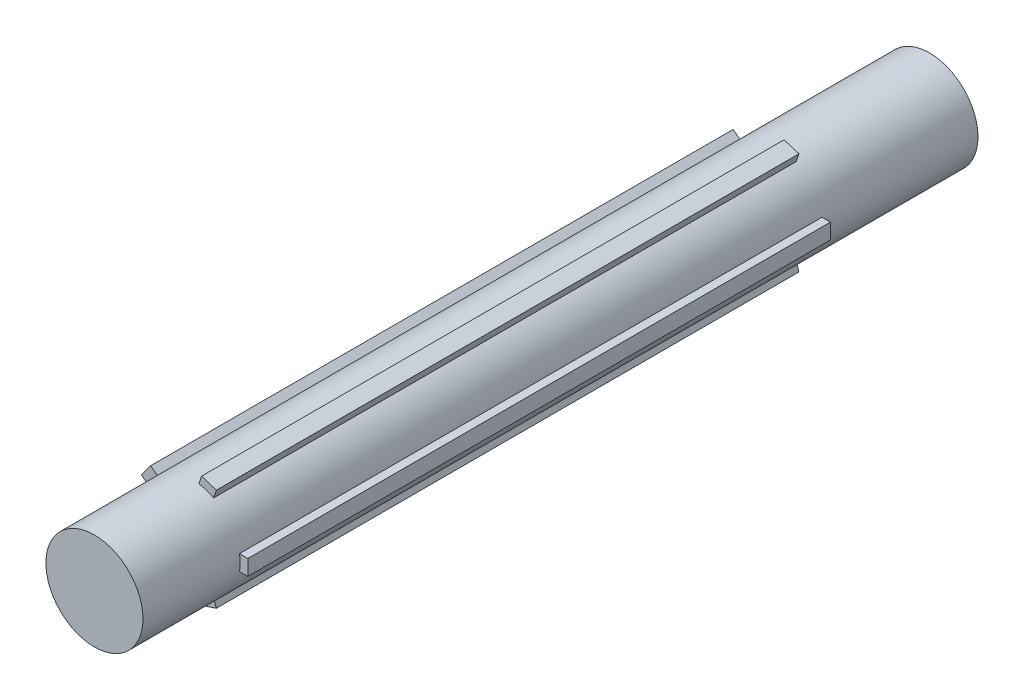
ISO-10303-21;
HEADER;
FILE_DESCRIPTION(('STEP AP214'),'2;1');
FILE_NAME('part.step','',(''),(''),'','','');
FILE_SCHEMA(('AUTOMOTIVE_DESIGN { 1 0 10303 214 1 1 1 1 }'));
ENDSEC;
DATA;
#1=APPLICATION_CONTEXT('core data for automotive mechanical design processes');
#2=APPLICATION_PROTOCOL_DEFINITION('international standard','automotive_design',2000,#1);
#3=PRODUCT_CONTEXT('',#1,'mechanical');
#4=PRODUCT('Part','Part','',(#3));
#5=PRODUCT_RELATED_PRODUCT_CATEGORY('part','',(#4));
#6=PRODUCT_DEFINITION_FORMATION('','',#4);
#7=PRODUCT_DEFINITION_CONTEXT('part definition',#1,'design');
#8=PRODUCT_DEFINITION('design','',#6,#7);
#9=PRODUCT_DEFINITION_SHAPE('','',#8);
#10=(LENGTH_UNIT() NAMED_UNIT(*) SI_UNIT(.MILLI.,.METRE.));
#11=(NAMED_UNIT(*) PLANE_ANGLE_UNIT() SI_UNIT($,.RADIAN.));
#12=(NAMED_UNIT(*) SI_UNIT($,.STERADIAN.) SOLID_ANGLE_UNIT());
#13=UNCERTAINTY_MEASURE_WITH_UNIT(LENGTH_MEASURE(1.E-05),#10,'distance_accuracy_value','');
#14=(GEOMETRIC_REPRESENTATION_CONTEXT(3) GLOBAL_UNCERTAINTY_ASSIGNED_CONTEXT((#13)) GLOBAL_UNIT_ASSIGNED_CONTEXT((#10,
#11,#12)) REPRESENTATION_CONTEXT('',''));
#15=CARTESIAN_POINT('',(0.,0.,0.));
#16=DIRECTION('',(0.,0.,1.));
#17=DIRECTION('',(1.,0.,0.));
#18=AXIS2_PLACEMENT_3D('',#15,#16,#17);
#19=CARTESIAN_POINT('',(0.,0.,215.));
#20=DIRECTION('',(0.,0.,-1.));
#21=DIRECTION('',(-1.,0.,0.));
#22=AXIS2_PLACEMENT_3D('',#19,#20,#21);
#23=CYLINDRICAL_SURFACE('',#22,12.5);
#24=DIRECTION('',(0.,0.,-1.));
#25=VECTOR('',#24,1.);
#26=CARTESIAN_POINT('',(5.71506219343786,11.1170168716764,215.));
#27=LINE('',#26,#25);
#28=CARTESIAN_POINT('',(5.71506219343786,11.1170168716764,40.));
#29=VERTEX_POINT('',#28);
#30=CARTESIAN_POINT('',(5.71506219343786,11.1170168716764,190.));
#31=VERTEX_POINT('',#30);
#32=EDGE_CURVE('E162',#29,#31,#27,.F.);
#33=ORIENTED_EDGE('',*,*,#32,.T.);
#34=CARTESIAN_POINT('',(0.,0.,190.));
#35=DIRECTION('',(0.,0.,1.));
#36=DIRECTION('',(1.,0.,0.));
#37=AXIS2_PLACEMENT_3D('',#34,#35,#36);
#38=CIRCLE('',#37,12.5);
#39=CARTESIAN_POINT('',(1.91083612825726,12.3530848491762,190.));
#40=VERTEX_POINT('',#39);
#41=EDGE_CURVE('E12',#31,#40,#38,.T.);
#42=ORIENTED_EDGE('',*,*,#41,.T.);
#43=DIRECTION('',(0.,0.,-1.));
#44=VECTOR('',#43,1.);
#45=CARTESIAN_POINT('',(1.91083612825726,12.3530848491762,215.));
#46=LINE('',#45,#44);
#47=CARTESIAN_POINT('',(1.91083612825726,12.3530848491762,40.));
#48=VERTEX_POINT('',#47);
#49=EDGE_CURVE('E454',#48,#40,#46,.F.);
#50=ORIENTED_EDGE('',*,*,#49,.F.);
#51=CARTESIAN_POINT('',(0.,0.,40.));
#52=DIRECTION('',(0.,0.,1.));
#53=DIRECTION('',(1.,0.,0.));
#54=AXIS2_PLACEMENT_3D('',#51,#52,#53);
#55=CIRCLE('',#54,12.5);
#56=EDGE_CURVE('E451',#29,#48,#55,.T.);
#57=ORIENTED_EDGE('',*,*,#56,.F.);
#58=EDGE_LOOP('',(#33,#42,#50,#57));
#59=FACE_BOUND('',#58,.T.);
#60=DIRECTION('',(0.,0.,-1.));
#61=VECTOR('',#60,1.);
#62=CARTESIAN_POINT('',(-8.80685999588894,8.87069428020215,215.));
#63=LINE('',#62,#61);
#64=CARTESIAN_POINT('',(-8.80685999588894,8.87069428020215,40.));
#65=VERTEX_POINT('',#64);
#66=CARTESIAN_POINT('',(-8.80685999588894,8.87069428020215,190.));
#67=VERTEX_POINT('',#66);
#68=EDGE_CURVE('E447',#65,#67,#63,.F.);
#69=ORIENTED_EDGE('',*,*,#68,.T.);
#70=CARTESIAN_POINT('',(0.,0.,190.));
#71=DIRECTION('',(0.,0.,1.));
#72=DIRECTION('',(1.,0.,0.));
#73=AXIS2_PLACEMENT_3D('',#70,#71,#72);
#74=CIRCLE('',#73,12.5);
#75=CARTESIAN_POINT('',(-11.1580010050589,5.63462630270238,190.));
#76=VERTEX_POINT('',#75);
#77=EDGE_CURVE('E449',#67,#76,#74,.T.);
#78=ORIENTED_EDGE('',*,*,#77,.T.);
#79=DIRECTION('',(0.,0.,-1.));
#80=VECTOR('',#79,1.);
#81=CARTESIAN_POINT('',(-11.1580010050589,5.63462630270238,215.));
#82=LINE('',#81,#80);
#83=CARTESIAN_POINT('',(-11.1580010050589,5.63462630270238,40.));
#84=VERTEX_POINT('',#83);
#85=EDGE_CURVE('E444',#84,#76,#82,.F.);
#86=ORIENTED_EDGE('',*,*,#85,.F.);
#87=CARTESIAN_POINT('',(0.,0.,40.));
#88=DIRECTION('',(0.,0.,1.));
#89=DIRECTION('',(1.,0.,0.));
#90=AXIS2_PLACEMENT_3D('',#87,#88,#89);
#91=CIRCLE('',#90,12.5);
#92=EDGE_CURVE('E441',#65,#84,#91,.T.);
#93=ORIENTED_EDGE('',*,*,#92,.F.);
#94=EDGE_LOOP('',(#69,#78,#86,#93));
#95=FACE_BOUND('',#94,.T.);
#96=DIRECTION('',(0.,0.,-1.));
#97=VECTOR('',#96,1.);
#98=CARTESIAN_POINT('',(-11.1580010050589,-5.63462630270222,215.));
#99=LINE('',#98,#97);
#100=CARTESIAN_POINT('',(-11.1580010050589,-5.63462630270222,40.));
#101=VERTEX_POINT('',#100);
#102=CARTESIAN_POINT('',(-11.1580010050589,-5.63462630270222,190.));
#103=VERTEX_POINT('',#102);
#104=EDGE_CURVE('E437',#101,#103,#99,.F.);
#105=ORIENTED_EDGE('',*,*,#104,.T.);
#106=CARTESIAN_POINT('',(0.,0.,190.));
#107=DIRECTION('',(0.,0.,1.));
#108=DIRECTION('',(1.,0.,0.));
#109=AXIS2_PLACEMENT_3D('',#106,#107,#108);
#110=CIRCLE('',#109,12.5);
#111=CARTESIAN_POINT('',(-8.80685999588907,-8.87069428020202,190.));
#112=VERTEX_POINT('',#111);
#113=EDGE_CURVE('E439',#103,#112,#110,.T.);
#114=ORIENTED_EDGE('',*,*,#113,.T.);
#115=DIRECTION('',(0.,0.,-1.));
#116=VECTOR('',#115,1.);
#117=CARTESIAN_POINT('',(-8.80685999588907,-8.87069428020202,215.));
#118=LINE('',#117,#116);
#119=CARTESIAN_POINT('',(-8.80685999588907,-8.87069428020202,40.));
#120=VERTEX_POINT('',#119);
#121=EDGE_CURVE('E434',#120,#112,#118,.F.);
#122=ORIENTED_EDGE('',*,*,#121,.F.);
#123=CARTESIAN_POINT('',(0.,0.,40.));
#124=DIRECTION('',(0.,0.,1.));
#125=DIRECTION('',(1.,0.,0.));
#126=AXIS2_PLACEMENT_3D('',#123,#124,#125);
#127=CIRCLE('',#126,12.5);
#128=EDGE_CURVE('E431',#101,#120,#127,.T.);
#129=ORIENTED_EDGE('',*,*,#128,.F.);
#130=EDGE_LOOP('',(#105,#114,#122,#129));
#131=FACE_BOUND('',#130,.T.);
#132=DIRECTION('',(0.,0.,-1.));
#133=VECTOR('',#132,1.);
#134=CARTESIAN_POINT('',(1.91083612825709,-12.3530848491762,215.));
#135=LINE('',#134,#133);
#136=CARTESIAN_POINT('',(1.91083612825709,-12.3530848491762,40.));
#137=VERTEX_POINT('',#136);
#138=CARTESIAN_POINT('',(1.91083612825709,-12.3530848491762,190.));
#139=VERTEX_POINT('',#138);
#140=EDGE_CURVE('E427',#137,#139,#135,.F.);
#141=ORIENTED_EDGE('',*,*,#140,.T.);
#142=CARTESIAN_POINT('',(0.,0.,190.));
#143=DIRECTION('',(0.,0.,1.));
#144=DIRECTION('',(1.,0.,0.));
#145=AXIS2_PLACEMENT_3D('',#142,#143,#144);
#146=CIRCLE('',#145,12.5);
#147=CARTESIAN_POINT('',(5.71506219343771,-11.1170168716765,190.));
#148=VERTEX_POINT('',#147);
#149=EDGE_CURVE('E429',#139,#148,#146,.T.);
#150=ORIENTED_EDGE('',*,*,#149,.T.);
#151=DIRECTION('',(0.,0.,-1.));
#152=VECTOR('',#151,1.);
#153=CARTESIAN_POINT('',(5.71506219343771,-11.1170168716765,215.));
#154=LINE('',#153,#152);
#155=CARTESIAN_POINT('',(5.71506219343771,-11.1170168716765,40.));
#156=VERTEX_POINT('',#155);
#157=EDGE_CURVE('E424',#156,#148,#154,.F.);
#158=ORIENTED_EDGE('',*,*,#157,.F.);
#159=CARTESIAN_POINT('',(0.,0.,40.));
#160=DIRECTION('',(0.,0.,1.));
#161=DIRECTION('',(1.,0.,0.));
#162=AXIS2_PLACEMENT_3D('',#159,#160,#161);
#163=CIRCLE('',#162,12.5);
#164=EDGE_CURVE('E421',#137,#156,#163,.T.);
#165=ORIENTED_EDGE('',*,*,#164,.F.);
#166=EDGE_LOOP('',(#141,#150,#158,#165));
#167=FACE_BOUND('',#166,.T.);
#168=CARTESIAN_POINT('',(0.,0.,0.));
#169=DIRECTION('',(0.,0.,1.));
#170=DIRECTION('',(1.,0.,0.));
#171=AXIS2_PLACEMENT_3D('',#168,#169,#170);
#172=CIRCLE('',#171,12.5);
#173=CARTESIAN_POINT('',(12.5,0.,0.));
#174=VERTEX_POINT('',#173);
#175=EDGE_CURVE('E404',#174,#174,#172,.T.);
#176=ORIENTED_EDGE('',*,*,#175,.T.);
#177=EDGE_LOOP('',(#176));
#178=FACE_BOUND('',#177,.T.);
#179=CARTESIAN_POINT('',(0.,0.,215.));
#180=DIRECTION('',(0.,0.,1.));
#181=DIRECTION('',(1.,0.,0.));
#182=AXIS2_PLACEMENT_3D('',#179,#180,#181);
#183=CIRCLE('',#182,12.5);
#184=CARTESIAN_POINT('',(12.5,0.,215.));
#185=VERTEX_POINT('',#184);
#186=EDGE_CURVE('E405',#185,#185,#183,.T.);
#187=ORIENTED_EDGE('',*,*,#186,.F.);
#188=EDGE_LOOP('',(#187));
#189=FACE_BOUND('',#188,.T.);
#190=CARTESIAN_POINT('',(0.,0.,40.));
#191=DIRECTION('',(0.,0.,1.));
#192=DIRECTION('',(1.,0.,0.));
#193=AXIS2_PLACEMENT_3D('',#190,#191,#192);
#194=CIRCLE('',#193,12.5);
#195=CARTESIAN_POINT('',(12.3389626792531,-2.,40.));
#196=VERTEX_POINT('',#195);
#197=CARTESIAN_POINT('',(12.3389626792531,2.,40.));
#198=VERTEX_POINT('',#197);
#199=EDGE_CURVE('E419',#196,#198,#194,.T.);
#200=ORIENTED_EDGE('',*,*,#199,.F.);
#201=DIRECTION('',(0.,0.,-1.));
#202=VECTOR('',#201,1.);
#203=CARTESIAN_POINT('',(12.3389626792531,-2.,215.));
#204=LINE('',#203,#202);
#205=CARTESIAN_POINT('',(12.3389626792531,-2.,190.));
#206=VERTEX_POINT('',#205);
#207=EDGE_CURVE('E416',#196,#206,#204,.F.);
#208=ORIENTED_EDGE('',*,*,#207,.T.);
#209=CARTESIAN_POINT('',(0.,0.,190.));
#210=DIRECTION('',(0.,0.,1.));
#211=DIRECTION('',(1.,0.,0.));
#212=AXIS2_PLACEMENT_3D('',#209,#210,#211);
#213=CIRCLE('',#212,12.5);
#214=CARTESIAN_POINT('',(12.3389626792531,2.,190.));
#215=VERTEX_POINT('',#214);
#216=EDGE_CURVE('E408',#206,#215,#213,.T.);
#217=ORIENTED_EDGE('',*,*,#216,.T.);
#218=DIRECTION('',(0.,0.,-1.));
#219=VECTOR('',#218,1.);
#220=CARTESIAN_POINT('',(12.3389626792531,2.,215.));
#221=LINE('',#220,#219);
#222=EDGE_CURVE('E413',#198,#215,#221,.F.);
#223=ORIENTED_EDGE('',*,*,#222,.F.);
#224=EDGE_LOOP('',(#200,#208,#217,#223));
#225=FACE_BOUND('',#224,.T.);
#226=ADVANCED_FACE('F155',(#59,#95,#131,#167,#178,#189,#225),#23,.T.);
#227=CARTESIAN_POINT('',(0.,0.,215.));
#228=DIRECTION('',(0.,0.,1.));
#229=DIRECTION('',(1.,0.,0.));
#230=AXIS2_PLACEMENT_3D('',#227,#228,#229);
#231=PLANE('',#230);
#232=ORIENTED_EDGE('',*,*,#186,.T.);
#233=EDGE_LOOP('',(#232));
#234=FACE_BOUND('',#233,.T.);
#235=ADVANCED_FACE('F469',(#234),#231,.T.);
#236=CARTESIAN_POINT('',(0.,0.,0.));
#237=DIRECTION('',(0.,0.,1.));
#238=DIRECTION('',(1.,0.,0.));
#239=AXIS2_PLACEMENT_3D('',#236,#237,#238);
#240=PLANE('',#239);
#241=ORIENTED_EDGE('',*,*,#175,.F.);
#242=EDGE_LOOP('',(#241));
#243=FACE_BOUND('',#242,.T.);
#244=ADVANCED_FACE('F473',(#243),#240,.F.);
#245=CARTESIAN_POINT('',(0.,-2.,190.));
#246=DIRECTION('',(0.,-1.,0.));
#247=DIRECTION('',(0.,0.,-1.));
#248=AXIS2_PLACEMENT_3D('',#245,#246,#247);
#249=PLANE('',#248);
#250=ORIENTED_EDGE('',*,*,#207,.F.);
#251=DIRECTION('',(-1.,0.,0.));
#252=VECTOR('',#251,1.);
#253=CARTESIAN_POINT('',(0.,-2.,40.));
#254=LINE('',#253,#252);
#255=CARTESIAN_POINT('',(14.5,-2.,40.));
#256=VERTEX_POINT('',#255);
#257=EDGE_CURVE('E383',#256,#196,#254,.T.);
#258=ORIENTED_EDGE('',*,*,#257,.F.);
#259=DIRECTION('',(0.,0.,-1.));
#260=VECTOR('',#259,1.);
#261=CARTESIAN_POINT('',(14.5,-2.,190.));
#262=LINE('',#261,#260);
#263=CARTESIAN_POINT('',(14.5,-2.,190.));
#264=VERTEX_POINT('',#263);
#265=EDGE_CURVE('E402',#264,#256,#262,.T.);
#266=ORIENTED_EDGE('',*,*,#265,.F.);
#267=DIRECTION('',(-1.,0.,0.));
#268=VECTOR('',#267,1.);
#269=CARTESIAN_POINT('',(0.,-2.,190.));
#270=LINE('',#269,#268);
#271=EDGE_CURVE('E384',#264,#206,#270,.T.);
#272=ORIENTED_EDGE('',*,*,#271,.T.);
#273=EDGE_LOOP('',(#250,#258,#266,#272));
#274=FACE_BOUND('',#273,.T.);
#275=ADVANCED_FACE('F479',(#274),#249,.T.);
#276=CARTESIAN_POINT('',(0.,2.,190.));
#277=DIRECTION('',(0.,-1.,0.));
#278=DIRECTION('',(1.,0.,0.));
#279=AXIS2_PLACEMENT_3D('',#276,#277,#278);
#280=PLANE('',#279);
#281=DIRECTION('',(-1.,0.,0.));
#282=VECTOR('',#281,1.);
#283=CARTESIAN_POINT('',(0.,2.,40.));
#284=LINE('',#283,#282);
#285=CARTESIAN_POINT('',(14.5,2.,40.));
#286=VERTEX_POINT('',#285);
#287=EDGE_CURVE('E388',#286,#198,#284,.T.);
#288=ORIENTED_EDGE('',*,*,#287,.T.);
#289=ORIENTED_EDGE('',*,*,#222,.T.);
#290=DIRECTION('',(-1.,0.,0.));
#291=VECTOR('',#290,1.);
#292=CARTESIAN_POINT('',(0.,2.,190.));
#293=LINE('',#292,#291);
#294=CARTESIAN_POINT('',(14.5,2.,190.));
#295=VERTEX_POINT('',#294);
#296=EDGE_CURVE('E391',#295,#215,#293,.T.);
#297=ORIENTED_EDGE('',*,*,#296,.F.);
#298=DIRECTION('',(0.,0.,-1.));
#299=VECTOR('',#298,1.);
#300=CARTESIAN_POINT('',(14.5,2.,190.));
#301=LINE('',#300,#299);
#302=EDGE_CURVE('E393',#295,#286,#301,.T.);
#303=ORIENTED_EDGE('',*,*,#302,.T.);
#304=EDGE_LOOP('',(#288,#289,#297,#303));
#305=FACE_BOUND('',#304,.T.);
#306=ADVANCED_FACE('F484',(#305),#280,.F.);
#307=CARTESIAN_POINT('',(14.5,0.,190.));
#308=DIRECTION('',(1.,0.,0.));
#309=DIRECTION('',(0.,0.,-1.));
#310=AXIS2_PLACEMENT_3D('',#307,#308,#309);
#311=PLANE('',#310);
#312=DIRECTION('',(0.,-1.,0.));
#313=VECTOR('',#312,1.);
#314=CARTESIAN_POINT('',(14.5,0.,40.));
#315=LINE('',#314,#313);
#316=EDGE_CURVE('E396',#286,#256,#315,.T.);
#317=ORIENTED_EDGE('',*,*,#316,.F.);
#318=ORIENTED_EDGE('',*,*,#302,.F.);
#319=DIRECTION('',(0.,-1.,0.));
#320=VECTOR('',#319,1.);
#321=CARTESIAN_POINT('',(14.5,0.,190.));
#322=LINE('',#321,#320);
#323=EDGE_CURVE('E387',#295,#264,#322,.T.);
#324=ORIENTED_EDGE('',*,*,#323,.T.);
#325=ORIENTED_EDGE('',*,*,#265,.T.);
#326=EDGE_LOOP('',(#317,#318,#324,#325));
#327=FACE_BOUND('',#326,.T.);
#328=ADVANCED_FACE('F486',(#327),#311,.T.);
#329=CARTESIAN_POINT('',(0.,0.,40.));
#330=DIRECTION('',(0.,0.,1.));
#331=DIRECTION('',(1.,0.,0.));
#332=AXIS2_PLACEMENT_3D('',#329,#330,#331);
#333=PLANE('',#332);
#334=ORIENTED_EDGE('',*,*,#257,.T.);
#335=ORIENTED_EDGE('',*,*,#199,.T.);
#336=ORIENTED_EDGE('',*,*,#287,.F.);
#337=ORIENTED_EDGE('',*,*,#316,.T.);
#338=EDGE_LOOP('',(#334,#335,#336,#337));
#339=FACE_BOUND('',#338,.T.);
#340=ADVANCED_FACE('F489',(#339),#333,.F.);
#341=CARTESIAN_POINT('',(0.,0.,190.));
#342=DIRECTION('',(0.,0.,1.));
#343=DIRECTION('',(1.,0.,0.));
#344=AXIS2_PLACEMENT_3D('',#341,#342,#343);
#345=PLANE('',#344);
#346=ORIENTED_EDGE('',*,*,#216,.F.);
#347=ORIENTED_EDGE('',*,*,#271,.F.);
#348=ORIENTED_EDGE('',*,*,#323,.F.);
#349=ORIENTED_EDGE('',*,*,#296,.T.);
#350=EDGE_LOOP('',(#346,#347,#348,#349));
#351=FACE_BOUND('',#350,.T.);
#352=ADVANCED_FACE('F491',(#351),#345,.T.);
#353=CARTESIAN_POINT('',(-1.90211303259031,-0.61803398874989,190.));
#354=DIRECTION('',(-0.951056516295154,-0.309016994374945,0.));
#355=DIRECTION('',(0.309016994374945,-0.951056516295155,0.));
#356=AXIS2_PLACEMENT_3D('',#353,#354,#355);
#357=PLANE('',#356);
#358=ORIENTED_EDGE('',*,*,#140,.F.);
#359=DIRECTION('',(-0.309016994374945,0.951056516295155,0.));
#360=VECTOR('',#359,1.);
#361=CARTESIAN_POINT('',(-1.90211303259031,-0.61803398874989,40.));
#362=LINE('',#361,#360);
#363=CARTESIAN_POINT('',(2.57863338584639,-14.4083534750296,40.));
#364=VERTEX_POINT('',#363);
#365=EDGE_CURVE('E361',#364,#137,#362,.T.);
#366=ORIENTED_EDGE('',*,*,#365,.F.);
#367=DIRECTION('',(0.,0.,-1.));
#368=VECTOR('',#367,1.);
#369=CARTESIAN_POINT('',(2.57863338584639,-14.4083534750296,190.));
#370=LINE('',#369,#368);
#371=CARTESIAN_POINT('',(2.57863338584639,-14.4083534750296,190.));
#372=VERTEX_POINT('',#371);
#373=EDGE_CURVE('E381',#372,#364,#370,.T.);
#374=ORIENTED_EDGE('',*,*,#373,.F.);
#375=DIRECTION('',(-0.309016994374945,0.951056516295155,0.));
#376=VECTOR('',#375,1.);
#377=CARTESIAN_POINT('',(-1.90211303259031,-0.61803398874989,190.));
#378=LINE('',#377,#376);
#379=EDGE_CURVE('E362',#372,#139,#378,.T.);
#380=ORIENTED_EDGE('',*,*,#379,.T.);
#381=EDGE_LOOP('',(#358,#366,#374,#380));
#382=FACE_BOUND('',#381,.T.);
#383=ADVANCED_FACE('F500',(#382),#357,.T.);
#384=CARTESIAN_POINT('',(1.90211303259031,0.618033988749889,190.));
#385=DIRECTION('',(-0.951056516295154,-0.309016994374945,0.));
#386=DIRECTION('',(0.309016994374945,-0.951056516295154,0.));
#387=AXIS2_PLACEMENT_3D('',#384,#385,#386);
#388=PLANE('',#387);
#389=DIRECTION('',(-0.309016994374945,0.951056516295155,0.));
#390=VECTOR('',#389,1.);
#391=CARTESIAN_POINT('',(1.90211303259031,0.618033988749889,40.));
#392=LINE('',#391,#390);
#393=CARTESIAN_POINT('',(6.38285945102701,-13.1722854975299,40.));
#394=VERTEX_POINT('',#393);
#395=EDGE_CURVE('E366',#394,#156,#392,.T.);
#396=ORIENTED_EDGE('',*,*,#395,.T.);
#397=ORIENTED_EDGE('',*,*,#157,.T.);
#398=DIRECTION('',(-0.309016994374945,0.951056516295155,0.));
#399=VECTOR('',#398,1.);
#400=CARTESIAN_POINT('',(1.90211303259031,0.618033988749889,190.));
#401=LINE('',#400,#399);
#402=CARTESIAN_POINT('',(6.38285945102701,-13.1722854975299,190.));
#403=VERTEX_POINT('',#402);
#404=EDGE_CURVE('E369',#403,#148,#401,.T.);
#405=ORIENTED_EDGE('',*,*,#404,.F.);
#406=DIRECTION('',(0.,0.,-1.));
#407=VECTOR('',#406,1.);
#408=CARTESIAN_POINT('',(6.38285945102701,-13.1722854975299,190.));
#409=LINE('',#408,#407);
#410=EDGE_CURVE('E372',#403,#394,#409,.T.);
#411=ORIENTED_EDGE('',*,*,#410,.T.);
#412=EDGE_LOOP('',(#396,#397,#405,#411));
#413=FACE_BOUND('',#412,.T.);
#414=ADVANCED_FACE('F504',(#413),#388,.F.);
#415=CARTESIAN_POINT('',(4.4807464184367,-13.7903194862797,190.));
#416=DIRECTION('',(0.309016994374945,-0.951056516295154,0.));
#417=DIRECTION('',(0.951056516295155,0.309016994374945,0.));
#418=AXIS2_PLACEMENT_3D('',#415,#416,#417);
#419=PLANE('',#418);
#420=DIRECTION('',(-0.951056516295155,-0.309016994374945,0.));
#421=VECTOR('',#420,1.);
#422=CARTESIAN_POINT('',(4.4807464184367,-13.7903194862797,40.));
#423=LINE('',#422,#421);
#424=EDGE_CURVE('E375',#394,#364,#423,.T.);
#425=ORIENTED_EDGE('',*,*,#424,.F.);
#426=ORIENTED_EDGE('',*,*,#410,.F.);
#427=DIRECTION('',(-0.951056516295155,-0.309016994374945,0.));
#428=VECTOR('',#427,1.);
#429=CARTESIAN_POINT('',(4.4807464184367,-13.7903194862797,190.));
#430=LINE('',#429,#428);
#431=EDGE_CURVE('E365',#403,#372,#430,.T.);
#432=ORIENTED_EDGE('',*,*,#431,.T.);
#433=ORIENTED_EDGE('',*,*,#373,.T.);
#434=EDGE_LOOP('',(#425,#426,#432,#433));
#435=FACE_BOUND('',#434,.T.);
#436=ADVANCED_FACE('F506',(#435),#419,.T.);
#437=CARTESIAN_POINT('',(0.,0.,190.));
#438=DIRECTION('',(0.,0.,1.));
#439=DIRECTION('',(0.309016994374945,-0.951056516295155,0.));
#440=AXIS2_PLACEMENT_3D('',#437,#438,#439);
#441=PLANE('',#440);
#442=ORIENTED_EDGE('',*,*,#149,.F.);
#443=ORIENTED_EDGE('',*,*,#379,.F.);
#444=ORIENTED_EDGE('',*,*,#431,.F.);
#445=ORIENTED_EDGE('',*,*,#404,.T.);
#446=EDGE_LOOP('',(#442,#443,#444,#445));
#447=FACE_BOUND('',#446,.T.);
#448=ADVANCED_FACE('F509',(#447),#441,.T.);
#449=CARTESIAN_POINT('',(0.,0.,40.));
#450=DIRECTION('',(0.,0.,1.));
#451=DIRECTION('',(0.309016994374945,-0.951056516295155,0.));
#452=AXIS2_PLACEMENT_3D('',#449,#450,#451);
#453=PLANE('',#452);
#454=ORIENTED_EDGE('',*,*,#365,.T.);
#455=ORIENTED_EDGE('',*,*,#164,.T.);
#456=ORIENTED_EDGE('',*,*,#395,.F.);
#457=ORIENTED_EDGE('',*,*,#424,.T.);
#458=EDGE_LOOP('',(#454,#455,#456,#457));
#459=FACE_BOUND('',#458,.T.);
#460=ADVANCED_FACE('F514',(#459),#453,.F.);
#461=CARTESIAN_POINT('',(-1.17557050458494,1.6180339887499,190.));
#462=DIRECTION('',(-0.587785252292469,0.809016994374951,0.));
#463=DIRECTION('',(-0.809016994374951,-0.587785252292469,0.));
#464=AXIS2_PLACEMENT_3D('',#461,#462,#463);
#465=PLANE('',#464);
#466=ORIENTED_EDGE('',*,*,#104,.F.);
#467=DIRECTION('',(0.809016994374951,0.587785252292469,0.));
#468=VECTOR('',#467,1.);
#469=CARTESIAN_POINT('',(-1.17557050458494,1.6180339887499,40.));
#470=LINE('',#469,#468);
#471=CARTESIAN_POINT('',(-12.9063169230217,-6.90485216949089,40.));
#472=VERTEX_POINT('',#471);
#473=EDGE_CURVE('E339',#472,#101,#470,.T.);
#474=ORIENTED_EDGE('',*,*,#473,.F.);
#475=DIRECTION('',(0.,0.,-1.));
#476=VECTOR('',#475,1.);
#477=CARTESIAN_POINT('',(-12.9063169230217,-6.90485216949089,190.));
#478=LINE('',#477,#476);
#479=CARTESIAN_POINT('',(-12.9063169230217,-6.90485216949089,190.));
#480=VERTEX_POINT('',#479);
#481=EDGE_CURVE('E359',#480,#472,#478,.T.);
#482=ORIENTED_EDGE('',*,*,#481,.F.);
#483=DIRECTION('',(0.809016994374951,0.587785252292469,0.));
#484=VECTOR('',#483,1.);
#485=CARTESIAN_POINT('',(-1.17557050458494,1.6180339887499,190.));
#486=LINE('',#485,#484);
#487=EDGE_CURVE('E340',#480,#103,#486,.T.);
#488=ORIENTED_EDGE('',*,*,#487,.T.);
#489=EDGE_LOOP('',(#466,#474,#482,#488));
#490=FACE_BOUND('',#489,.T.);
#491=ADVANCED_FACE('F517',(#490),#465,.T.);
#492=CARTESIAN_POINT('',(1.17557050458494,-1.6180339887499,190.));
#493=DIRECTION('',(-0.587785252292469,0.809016994374951,0.));
#494=DIRECTION('',(-0.809016994374951,-0.587785252292469,0.));
#495=AXIS2_PLACEMENT_3D('',#492,#493,#494);
#496=PLANE('',#495);
#497=DIRECTION('',(0.809016994374951,0.587785252292469,0.));
#498=VECTOR('',#497,1.);
#499=CARTESIAN_POINT('',(1.17557050458494,-1.6180339887499,40.));
#500=LINE('',#499,#498);
#501=CARTESIAN_POINT('',(-10.5551759138518,-10.1409201469907,40.));
#502=VERTEX_POINT('',#501);
#503=EDGE_CURVE('E344',#502,#120,#500,.T.);
#504=ORIENTED_EDGE('',*,*,#503,.T.);
#505=ORIENTED_EDGE('',*,*,#121,.T.);
#506=DIRECTION('',(0.809016994374951,0.587785252292469,0.));
#507=VECTOR('',#506,1.);
#508=CARTESIAN_POINT('',(1.17557050458494,-1.6180339887499,190.));
#509=LINE('',#508,#507);
#510=CARTESIAN_POINT('',(-10.5551759138518,-10.1409201469907,190.));
#511=VERTEX_POINT('',#510);
#512=EDGE_CURVE('E347',#511,#112,#509,.T.);
#513=ORIENTED_EDGE('',*,*,#512,.F.);
#514=DIRECTION('',(0.,0.,-1.));
#515=VECTOR('',#514,1.);
#516=CARTESIAN_POINT('',(-10.5551759138518,-10.1409201469907,190.));
#517=LINE('',#516,#515);
#518=EDGE_CURVE('E350',#511,#502,#517,.T.);
#519=ORIENTED_EDGE('',*,*,#518,.T.);
#520=EDGE_LOOP('',(#504,#505,#513,#519));
#521=FACE_BOUND('',#520,.T.);
#522=ADVANCED_FACE('F524',(#521),#496,.F.);
#523=CARTESIAN_POINT('',(-11.7307464184368,-8.52288615824079,190.));
#524=DIRECTION('',(-0.809016994374951,-0.587785252292469,0.));
#525=DIRECTION('',(0.587785252292469,-0.809016994374951,0.));
#526=AXIS2_PLACEMENT_3D('',#523,#524,#525);
#527=PLANE('',#526);
#528=DIRECTION('',(-0.587785252292469,0.809016994374951,0.));
#529=VECTOR('',#528,1.);
#530=CARTESIAN_POINT('',(-11.7307464184368,-8.52288615824079,40.));
#531=LINE('',#530,#529);
#532=EDGE_CURVE('E353',#502,#472,#531,.T.);
#533=ORIENTED_EDGE('',*,*,#532,.F.);
#534=ORIENTED_EDGE('',*,*,#518,.F.);
#535=DIRECTION('',(-0.587785252292469,0.809016994374951,0.));
#536=VECTOR('',#535,1.);
#537=CARTESIAN_POINT('',(-11.7307464184368,-8.52288615824079,190.));
#538=LINE('',#537,#536);
#539=EDGE_CURVE('E343',#511,#480,#538,.T.);
#540=ORIENTED_EDGE('',*,*,#539,.T.);
#541=ORIENTED_EDGE('',*,*,#481,.T.);
#542=EDGE_LOOP('',(#533,#534,#540,#541));
#543=FACE_BOUND('',#542,.T.);
#544=ADVANCED_FACE('F526',(#543),#527,.T.);
#545=CARTESIAN_POINT('',(0.,0.,190.));
#546=DIRECTION('',(0.,0.,1.));
#547=DIRECTION('',(-0.809016994374951,-0.587785252292469,0.));
#548=AXIS2_PLACEMENT_3D('',#545,#546,#547);
#549=PLANE('',#548);
#550=ORIENTED_EDGE('',*,*,#113,.F.);
#551=ORIENTED_EDGE('',*,*,#487,.F.);
#552=ORIENTED_EDGE('',*,*,#539,.F.);
#553=ORIENTED_EDGE('',*,*,#512,.T.);
#554=EDGE_LOOP('',(#550,#551,#552,#553));
#555=FACE_BOUND('',#554,.T.);
#556=ADVANCED_FACE('F529',(#555),#549,.T.);
#557=CARTESIAN_POINT('',(0.,0.,40.));
#558=DIRECTION('',(0.,0.,1.));
#559=DIRECTION('',(-0.809016994374951,-0.587785252292469,0.));
#560=AXIS2_PLACEMENT_3D('',#557,#558,#559);
#561=PLANE('',#560);
#562=ORIENTED_EDGE('',*,*,#473,.T.);
#563=ORIENTED_EDGE('',*,*,#128,.T.);
#564=ORIENTED_EDGE('',*,*,#503,.F.);
#565=ORIENTED_EDGE('',*,*,#532,.T.);
#566=EDGE_LOOP('',(#562,#563,#564,#565));
#567=FACE_BOUND('',#566,.T.);
#568=ADVANCED_FACE('F534',(#567),#561,.F.);
#569=CARTESIAN_POINT('',(1.17557050458496,1.61803398874988,190.));
#570=DIRECTION('',(0.58778525229248,0.809016994374942,0.));
#571=DIRECTION('',(-0.809016994374942,0.58778525229248,0.));
#572=AXIS2_PLACEMENT_3D('',#569,#570,#571);
#573=PLANE('',#572);
#574=ORIENTED_EDGE('',*,*,#68,.F.);
#575=DIRECTION('',(0.809016994374942,-0.58778525229248,0.));
#576=VECTOR('',#575,1.);
#577=CARTESIAN_POINT('',(1.17557050458496,1.61803398874988,40.));
#578=LINE('',#577,#576);
#579=CARTESIAN_POINT('',(-10.5551759138517,10.1409201469908,40.));
#580=VERTEX_POINT('',#579);
#581=EDGE_CURVE('E296',#580,#65,#578,.T.);
#582=ORIENTED_EDGE('',*,*,#581,.F.);
#583=DIRECTION('',(0.,0.,-1.));
#584=VECTOR('',#583,1.);
#585=CARTESIAN_POINT('',(-10.5551759138517,10.1409201469908,190.));
#586=LINE('',#585,#584);
#587=CARTESIAN_POINT('',(-10.5551759138517,10.1409201469908,190.));
#588=VERTEX_POINT('',#587);
#589=EDGE_CURVE('E337',#588,#580,#586,.T.);
#590=ORIENTED_EDGE('',*,*,#589,.F.);
#591=DIRECTION('',(0.809016994374942,-0.58778525229248,0.));
#592=VECTOR('',#591,1.);
#593=CARTESIAN_POINT('',(1.17557050458496,1.61803398874988,190.));
#594=LINE('',#593,#592);
#595=EDGE_CURVE('E318',#588,#67,#594,.T.);
#596=ORIENTED_EDGE('',*,*,#595,.T.);
#597=EDGE_LOOP('',(#574,#582,#590,#596));
#598=FACE_BOUND('',#597,.T.);
#599=ADVANCED_FACE('F537',(#598),#573,.T.);
#600=CARTESIAN_POINT('',(-1.17557050458496,-1.61803398874988,190.));
#601=DIRECTION('',(0.58778525229248,0.809016994374942,0.));
#602=DIRECTION('',(-0.809016994374942,0.58778525229248,0.));
#603=AXIS2_PLACEMENT_3D('',#600,#601,#602);
#604=PLANE('',#603);
#605=DIRECTION('',(0.809016994374942,-0.58778525229248,0.));
#606=VECTOR('',#605,1.);
#607=CARTESIAN_POINT('',(-1.17557050458496,-1.61803398874988,40.));
#608=LINE('',#607,#606);
#609=CARTESIAN_POINT('',(-12.9063169230216,6.90485216949108,40.));
#610=VERTEX_POINT('',#609);
#611=EDGE_CURVE('E322',#610,#84,#608,.T.);
#612=ORIENTED_EDGE('',*,*,#611,.T.);
#613=ORIENTED_EDGE('',*,*,#85,.T.);
#614=DIRECTION('',(0.809016994374942,-0.58778525229248,0.));
#615=VECTOR('',#614,1.);
#616=CARTESIAN_POINT('',(-1.17557050458496,-1.61803398874988,190.));
#617=LINE('',#616,#615);
#618=CARTESIAN_POINT('',(-12.9063169230216,6.90485216949108,190.));
#619=VERTEX_POINT('',#618);
#620=EDGE_CURVE('E325',#619,#76,#617,.T.);
#621=ORIENTED_EDGE('',*,*,#620,.F.);
#622=DIRECTION('',(0.,0.,-1.));
#623=VECTOR('',#622,1.);
#624=CARTESIAN_POINT('',(-12.9063169230216,6.90485216949108,190.));
#625=LINE('',#624,#623);
#626=EDGE_CURVE('E328',#619,#610,#625,.T.);
#627=ORIENTED_EDGE('',*,*,#626,.T.);
#628=EDGE_LOOP('',(#612,#613,#621,#627));
#629=FACE_BOUND('',#628,.T.);
#630=ADVANCED_FACE('F544',(#629),#604,.F.);
#631=CARTESIAN_POINT('',(-11.7307464184367,8.52288615824096,190.));
#632=DIRECTION('',(-0.809016994374942,0.58778525229248,0.));
#633=DIRECTION('',(-0.58778525229248,-0.809016994374942,0.));
#634=AXIS2_PLACEMENT_3D('',#631,#632,#633);
#635=PLANE('',#634);
#636=DIRECTION('',(0.58778525229248,0.809016994374942,0.));
#637=VECTOR('',#636,1.);
#638=CARTESIAN_POINT('',(-11.7307464184367,8.52288615824096,40.));
#639=LINE('',#638,#637);
#640=EDGE_CURVE('E331',#610,#580,#639,.T.);
#641=ORIENTED_EDGE('',*,*,#640,.F.);
#642=ORIENTED_EDGE('',*,*,#626,.F.);
#643=DIRECTION('',(0.58778525229248,0.809016994374942,0.));
#644=VECTOR('',#643,1.);
#645=CARTESIAN_POINT('',(-11.7307464184367,8.52288615824096,190.));
#646=LINE('',#645,#644);
#647=EDGE_CURVE('E321',#619,#588,#646,.T.);
#648=ORIENTED_EDGE('',*,*,#647,.T.);
#649=ORIENTED_EDGE('',*,*,#589,.T.);
#650=EDGE_LOOP('',(#641,#642,#648,#649));
#651=FACE_BOUND('',#650,.T.);
#652=ADVANCED_FACE('F546',(#651),#635,.T.);
#653=CARTESIAN_POINT('',(0.,0.,190.));
#654=DIRECTION('',(0.,0.,1.));
#655=DIRECTION('',(-0.809016994374942,0.58778525229248,0.));
#656=AXIS2_PLACEMENT_3D('',#653,#654,#655);
#657=PLANE('',#656);
#658=ORIENTED_EDGE('',*,*,#77,.F.);
#659=ORIENTED_EDGE('',*,*,#595,.F.);
#660=ORIENTED_EDGE('',*,*,#647,.F.);
#661=ORIENTED_EDGE('',*,*,#620,.T.);
#662=EDGE_LOOP('',(#658,#659,#660,#661));
#663=FACE_BOUND('',#662,.T.);
#664=ADVANCED_FACE('F549',(#663),#657,.T.);
#665=CARTESIAN_POINT('',(0.,0.,40.));
#666=DIRECTION('',(0.,0.,1.));
#667=DIRECTION('',(-0.809016994374942,0.58778525229248,0.));
#668=AXIS2_PLACEMENT_3D('',#665,#666,#667);
#669=PLANE('',#668);
#670=ORIENTED_EDGE('',*,*,#581,.T.);
#671=ORIENTED_EDGE('',*,*,#92,.T.);
#672=ORIENTED_EDGE('',*,*,#611,.F.);
#673=ORIENTED_EDGE('',*,*,#640,.T.);
#674=EDGE_LOOP('',(#670,#671,#672,#673));
#675=FACE_BOUND('',#674,.T.);
#676=ADVANCED_FACE('F554',(#675),#669,.F.);
#677=CARTESIAN_POINT('',(1.9021130325903,-0.618033988749917,190.));
#678=DIRECTION('',(0.95105651629515,-0.309016994374958,0.));
#679=DIRECTION('',(0.309016994374958,0.95105651629515,0.));
#680=AXIS2_PLACEMENT_3D('',#677,#678,#679);
#681=PLANE('',#680);
#682=ORIENTED_EDGE('',*,*,#32,.F.);
#683=DIRECTION('',(-0.309016994374958,-0.95105651629515,0.));
#684=VECTOR('',#683,1.);
#685=CARTESIAN_POINT('',(1.9021130325903,-0.618033988749917,40.));
#686=LINE('',#685,#684);
#687=CARTESIAN_POINT('',(6.38285945102719,13.1722854975298,40.));
#688=VERTEX_POINT('',#687);
#689=EDGE_CURVE('E291',#688,#29,#686,.T.);
#690=ORIENTED_EDGE('',*,*,#689,.F.);
#691=DIRECTION('',(0.,0.,-1.));
#692=VECTOR('',#691,1.);
#693=CARTESIAN_POINT('',(6.38285945102719,13.1722854975298,190.));
#694=LINE('',#693,#692);
#695=CARTESIAN_POINT('',(6.38285945102719,13.1722854975298,190.));
#696=VERTEX_POINT('',#695);
#697=EDGE_CURVE('E286',#696,#688,#694,.T.);
#698=ORIENTED_EDGE('',*,*,#697,.F.);
#699=DIRECTION('',(-0.309016994374958,-0.95105651629515,0.));
#700=VECTOR('',#699,1.);
#701=CARTESIAN_POINT('',(1.9021130325903,-0.618033988749917,190.));
#702=LINE('',#701,#700);
#703=EDGE_CURVE('E289',#696,#31,#702,.T.);
#704=ORIENTED_EDGE('',*,*,#703,.T.);
#705=EDGE_LOOP('',(#682,#690,#698,#704));
#706=FACE_BOUND('',#705,.T.);
#707=ADVANCED_FACE('F288',(#706),#681,.T.);
#708=CARTESIAN_POINT('',(-1.9021130325903,0.618033988749916,190.));
#709=DIRECTION('',(0.95105651629515,-0.309016994374958,0.));
#710=DIRECTION('',(0.309016994374958,0.95105651629515,0.));
#711=AXIS2_PLACEMENT_3D('',#708,#709,#710);
#712=PLANE('',#711);
#713=DIRECTION('',(-0.309016994374958,-0.95105651629515,0.));
#714=VECTOR('',#713,1.);
#715=CARTESIAN_POINT('',(-1.9021130325903,0.618033988749916,40.));
#716=LINE('',#715,#714);
#717=CARTESIAN_POINT('',(2.57863338584659,14.4083534750296,40.));
#718=VERTEX_POINT('',#717);
#719=EDGE_CURVE('E304',#718,#48,#716,.T.);
#720=ORIENTED_EDGE('',*,*,#719,.T.);
#721=ORIENTED_EDGE('',*,*,#49,.T.);
#722=DIRECTION('',(-0.309016994374958,-0.95105651629515,0.));
#723=VECTOR('',#722,1.);
#724=CARTESIAN_POINT('',(-1.9021130325903,0.618033988749916,190.));
#725=LINE('',#724,#723);
#726=CARTESIAN_POINT('',(2.57863338584659,14.4083534750296,190.));
#727=VERTEX_POINT('',#726);
#728=EDGE_CURVE('E308',#727,#40,#725,.T.);
#729=ORIENTED_EDGE('',*,*,#728,.F.);
#730=DIRECTION('',(0.,0.,-1.));
#731=VECTOR('',#730,1.);
#732=CARTESIAN_POINT('',(2.57863338584659,14.4083534750296,190.));
#733=LINE('',#732,#731);
#734=EDGE_CURVE('E297',#727,#718,#733,.T.);
#735=ORIENTED_EDGE('',*,*,#734,.T.);
#736=EDGE_LOOP('',(#720,#721,#729,#735));
#737=FACE_BOUND('',#736,.T.);
#738=ADVANCED_FACE('F456',(#737),#712,.F.);
#739=CARTESIAN_POINT('',(4.48074641843689,13.7903194862797,190.));
#740=DIRECTION('',(0.309016994374958,0.95105651629515,0.));
#741=DIRECTION('',(-0.95105651629515,0.309016994374958,0.));
#742=AXIS2_PLACEMENT_3D('',#739,#740,#741);
#743=PLANE('',#742);
#744=DIRECTION('',(0.95105651629515,-0.309016994374958,0.));
#745=VECTOR('',#744,1.);
#746=CARTESIAN_POINT('',(4.48074641843689,13.7903194862797,40.));
#747=LINE('',#746,#745);
#748=EDGE_CURVE('E313',#718,#688,#747,.T.);
#749=ORIENTED_EDGE('',*,*,#748,.F.);
#750=ORIENTED_EDGE('',*,*,#734,.F.);
#751=DIRECTION('',(0.95105651629515,-0.309016994374958,0.));
#752=VECTOR('',#751,1.);
#753=CARTESIAN_POINT('',(4.48074641843689,13.7903194862797,190.));
#754=LINE('',#753,#752);
#755=EDGE_CURVE('E303',#727,#696,#754,.T.);
#756=ORIENTED_EDGE('',*,*,#755,.T.);
#757=ORIENTED_EDGE('',*,*,#697,.T.);
#758=EDGE_LOOP('',(#749,#750,#756,#757));
#759=FACE_BOUND('',#758,.T.);
#760=ADVANCED_FACE('F306',(#759),#743,.T.);
#761=CARTESIAN_POINT('',(0.,0.,190.));
#762=DIRECTION('',(0.,0.,1.));
#763=DIRECTION('',(0.309016994374958,0.95105651629515,0.));
#764=AXIS2_PLACEMENT_3D('',#761,#762,#763);
#765=PLANE('',#764);
#766=ORIENTED_EDGE('',*,*,#41,.F.);
#767=ORIENTED_EDGE('',*,*,#703,.F.);
#768=ORIENTED_EDGE('',*,*,#755,.F.);
#769=ORIENTED_EDGE('',*,*,#728,.T.);
#770=EDGE_LOOP('',(#766,#767,#768,#769));
#771=FACE_BOUND('',#770,.T.);
#772=ADVANCED_FACE('F301',(#771),#765,.T.);
#773=CARTESIAN_POINT('',(0.,0.,40.));
#774=DIRECTION('',(0.,0.,1.));
#775=DIRECTION('',(0.309016994374958,0.95105651629515,0.));
#776=AXIS2_PLACEMENT_3D('',#773,#774,#775);
#777=PLANE('',#776);
#778=ORIENTED_EDGE('',*,*,#689,.T.);
#779=ORIENTED_EDGE('',*,*,#56,.T.);
#780=ORIENTED_EDGE('',*,*,#719,.F.);
#781=ORIENTED_EDGE('',*,*,#748,.T.);
#782=EDGE_LOOP('',(#778,#779,#780,#781));
#783=FACE_BOUND('',#782,.T.);
#784=ADVANCED_FACE('F460',(#783),#777,.F.);
#785=CLOSED_SHELL('',(#226,#235,#244,#275,#306,#328,#340,#352,#383,#414,#436,#448,#460,#491,
#522,#544,#556,#568,#599,#630,#652,#664,#676,#707,#738,#760,#772,#784));
#786=MANIFOLD_SOLID_BREP('B2',#785);
#787=ADVANCED_BREP_SHAPE_REPRESENTATION('',(#18,#786),#14);
#788=SHAPE_DEFINITION_REPRESENTATION(#9,#787);
ENDSEC;
END-ISO-10303-21;
